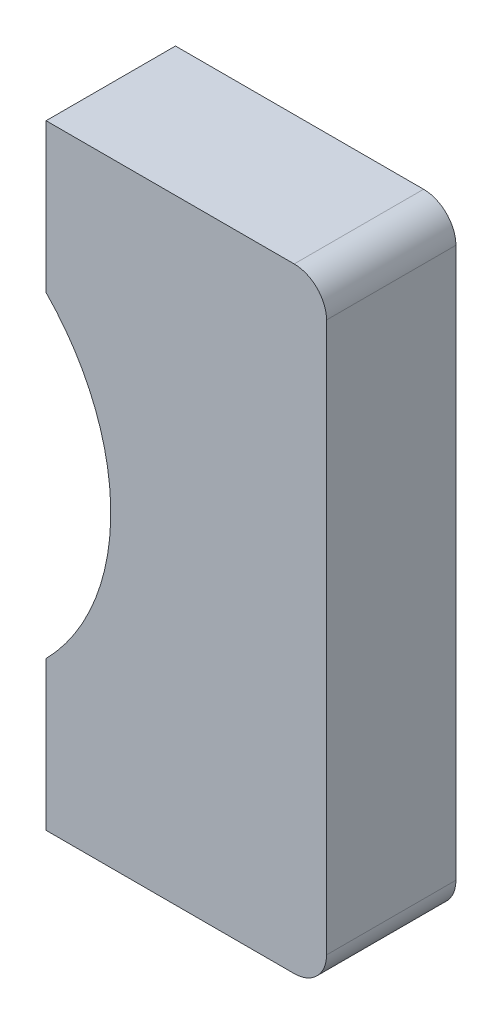
ISO-10303-21;
HEADER;
FILE_DESCRIPTION(('STEP AP214'),'2;1');
FILE_NAME('part.step','',(''),(''),'','','');
FILE_SCHEMA(('AUTOMOTIVE_DESIGN { 1 0 10303 214 1 1 1 1 }'));
ENDSEC;
DATA;
#1=APPLICATION_CONTEXT('core data for automotive mechanical design processes');
#2=APPLICATION_PROTOCOL_DEFINITION('international standard','automotive_design',2000,#1);
#3=PRODUCT_CONTEXT('',#1,'mechanical');
#4=PRODUCT('Part','Part','',(#3));
#5=PRODUCT_RELATED_PRODUCT_CATEGORY('part','',(#4));
#6=PRODUCT_DEFINITION_FORMATION('','',#4);
#7=PRODUCT_DEFINITION_CONTEXT('part definition',#1,'design');
#8=PRODUCT_DEFINITION('design','',#6,#7);
#9=PRODUCT_DEFINITION_SHAPE('','',#8);
#10=(LENGTH_UNIT() NAMED_UNIT(*) SI_UNIT(.MILLI.,.METRE.));
#11=(NAMED_UNIT(*) PLANE_ANGLE_UNIT() SI_UNIT($,.RADIAN.));
#12=(NAMED_UNIT(*) SI_UNIT($,.STERADIAN.) SOLID_ANGLE_UNIT());
#13=UNCERTAINTY_MEASURE_WITH_UNIT(LENGTH_MEASURE(1.E-05),#10,'distance_accuracy_value','');
#14=(GEOMETRIC_REPRESENTATION_CONTEXT(3) GLOBAL_UNCERTAINTY_ASSIGNED_CONTEXT((#13)) GLOBAL_UNIT_ASSIGNED_CONTEXT((#10,
#11,#12)) REPRESENTATION_CONTEXT('',''));
#15=CARTESIAN_POINT('',(0.,0.,0.));
#16=DIRECTION('',(0.,0.,1.));
#17=DIRECTION('',(1.,0.,0.));
#18=AXIS2_PLACEMENT_3D('',#15,#16,#17);
#19=CARTESIAN_POINT('',(7.21607439875603,-0.126900864643503,2.));
#20=DIRECTION('',(-1.,0.,0.));
#21=DIRECTION('',(0.,-1.,-4.37113882867379E-08));
#22=AXIS2_PLACEMENT_3D('',#19,#20,#21);
#23=PLANE('',#22);
#24=DIRECTION('',(0.,0.999999999999999,4.37113882867379E-08));
#25=VECTOR('',#24,1.);
#26=CARTESIAN_POINT('',(7.21607439875603,-4.37690077722073,-1.85773400218636E-07));
#27=LINE('',#26,#25);
#28=CARTESIAN_POINT('',(7.21607439875603,-4.37690077722073,-1.85773400218636E-07));
#29=VERTEX_POINT('',#28);
#30=CARTESIAN_POINT('',(7.21607439875603,4.12309922277927,1.85773400218636E-07));
#31=VERTEX_POINT('',#30);
#32=EDGE_CURVE('E11',#29,#31,#27,.T.);
#33=ORIENTED_EDGE('',*,*,#32,.T.);
#34=DIRECTION('',(0.,4.37113882867379E-08,-0.999999999999999));
#35=VECTOR('',#34,1.);
#36=CARTESIAN_POINT('',(7.21607439875603,4.1230991353565,2.0000001857734));
#37=LINE('',#36,#35);
#38=CARTESIAN_POINT('',(7.21607439875603,4.1230991353565,2.0000001857734));
#39=VERTEX_POINT('',#38);
#40=EDGE_CURVE('E146',#39,#31,#37,.T.);
#41=ORIENTED_EDGE('',*,*,#40,.F.);
#42=DIRECTION('',(0.,0.999999999999999,4.37113882867379E-08));
#43=VECTOR('',#42,1.);
#44=CARTESIAN_POINT('',(7.21607439875603,-4.3769008646435,1.9999998142266));
#45=LINE('',#44,#43);
#46=CARTESIAN_POINT('',(7.21607439875603,-4.3769008646435,1.9999998142266));
#47=VERTEX_POINT('',#46);
#48=EDGE_CURVE('E140',#47,#39,#45,.T.);
#49=ORIENTED_EDGE('',*,*,#48,.F.);
#50=DIRECTION('',(0.,4.37113882867379E-08,-0.999999999999999));
#51=VECTOR('',#50,1.);
#52=CARTESIAN_POINT('',(7.21607439875603,-4.3769008646435,1.9999998142266));
#53=LINE('',#52,#51);
#54=EDGE_CURVE('E97',#47,#29,#53,.T.);
#55=ORIENTED_EDGE('',*,*,#54,.T.);
#56=EDGE_LOOP('',(#33,#41,#49,#55));
#57=FACE_BOUND('',#56,.T.);
#58=ADVANCED_FACE('F17',(#57),#23,.F.);
#59=CARTESIAN_POINT('',(6.71607439875603,4.1230991353565,2.0000001857734));
#60=DIRECTION('',(0.,4.37113882867379E-08,-1.));
#61=DIRECTION('',(0.,1.,4.37113882867379E-08));
#62=AXIS2_PLACEMENT_3D('',#59,#60,#61);
#63=CYLINDRICAL_SURFACE('',#62,0.5);
#64=CARTESIAN_POINT('',(6.71607439875603,4.12309922277927,1.85773400218636E-07));
#65=DIRECTION('',(0.,-4.37113882867379E-08,1.));
#66=DIRECTION('',(1.,0.,0.));
#67=AXIS2_PLACEMENT_3D('',#64,#65,#66);
#68=CIRCLE('',#67,0.5);
#69=CARTESIAN_POINT('',(6.71607439875603,4.62309922277927,2.07629094362005E-07));
#70=VERTEX_POINT('',#69);
#71=EDGE_CURVE('E24',#31,#70,#68,.T.);
#72=ORIENTED_EDGE('',*,*,#71,.T.);
#73=DIRECTION('',(0.,4.37113882867379E-08,-0.999999999999999));
#74=VECTOR('',#73,1.);
#75=CARTESIAN_POINT('',(6.71607439875603,4.6230991353565,2.00000020762909));
#76=LINE('',#75,#74);
#77=CARTESIAN_POINT('',(6.71607439875603,4.6230991353565,2.00000020762909));
#78=VERTEX_POINT('',#77);
#79=EDGE_CURVE('E142',#78,#70,#76,.T.);
#80=ORIENTED_EDGE('',*,*,#79,.F.);
#81=CARTESIAN_POINT('',(6.71607439875603,4.1230991353565,2.0000001857734));
#82=DIRECTION('',(0.,-4.37113882867379E-08,1.));
#83=DIRECTION('',(1.,0.,0.));
#84=AXIS2_PLACEMENT_3D('',#81,#82,#83);
#85=CIRCLE('',#84,0.5);
#86=EDGE_CURVE('E132',#39,#78,#85,.T.);
#87=ORIENTED_EDGE('',*,*,#86,.F.);
#88=ORIENTED_EDGE('',*,*,#40,.T.);
#89=EDGE_LOOP('',(#72,#80,#87,#88));
#90=FACE_BOUND('',#89,.T.);
#91=ADVANCED_FACE('F148',(#90),#63,.T.);
#92=CARTESIAN_POINT('',(0.381074398756027,4.6230991353565,2.00000020762909));
#93=DIRECTION('',(0.,-1.,-4.37113882867379E-08));
#94=DIRECTION('',(1.,0.,0.));
#95=AXIS2_PLACEMENT_3D('',#92,#93,#94);
#96=PLANE('',#95);
#97=DIRECTION('',(-1.,0.,0.));
#98=VECTOR('',#97,1.);
#99=CARTESIAN_POINT('',(6.71607439875603,4.62309922277927,2.07629094362005E-07));
#100=LINE('',#99,#98);
#101=CARTESIAN_POINT('',(2.88107439875603,4.62309922277927,2.07629094362005E-07));
#102=VERTEX_POINT('',#101);
#103=EDGE_CURVE('E144',#70,#102,#100,.T.);
#104=ORIENTED_EDGE('',*,*,#103,.T.);
#105=DIRECTION('',(0.,4.37113882867379E-08,-0.999999999999999));
#106=VECTOR('',#105,1.);
#107=CARTESIAN_POINT('',(2.88107439875603,4.6230991353565,2.00000020762909));
#108=LINE('',#107,#106);
#109=CARTESIAN_POINT('',(2.88107439875603,4.6230991353565,2.00000020762909));
#110=VERTEX_POINT('',#109);
#111=EDGE_CURVE('E135',#110,#102,#108,.T.);
#112=ORIENTED_EDGE('',*,*,#111,.F.);
#113=DIRECTION('',(-1.,0.,0.));
#114=VECTOR('',#113,1.);
#115=CARTESIAN_POINT('',(6.71607439875603,4.6230991353565,2.00000020762909));
#116=LINE('',#115,#114);
#117=EDGE_CURVE('E122',#78,#110,#116,.T.);
#118=ORIENTED_EDGE('',*,*,#117,.F.);
#119=ORIENTED_EDGE('',*,*,#79,.T.);
#120=EDGE_LOOP('',(#104,#112,#118,#119));
#121=FACE_BOUND('',#120,.T.);
#122=ADVANCED_FACE('F154',(#121),#96,.F.);
#123=CARTESIAN_POINT('',(2.88107439875603,-0.126900864643503,2.));
#124=DIRECTION('',(1.,0.,0.));
#125=DIRECTION('',(0.,1.,4.37113882867379E-08));
#126=AXIS2_PLACEMENT_3D('',#123,#124,#125);
#127=PLANE('',#126);
#128=DIRECTION('',(0.,-0.999999999999999,-4.37113882867379E-08));
#129=VECTOR('',#128,1.);
#130=CARTESIAN_POINT('',(2.88107439875603,4.62309922277927,2.07629094362005E-07));
#131=LINE('',#130,#129);
#132=CARTESIAN_POINT('',(2.88107439875603,2.32258896556227,1.0707059725117E-07));
#133=VERTEX_POINT('',#132);
#134=EDGE_CURVE('E138',#102,#133,#131,.T.);
#135=ORIENTED_EDGE('',*,*,#134,.T.);
#136=DIRECTION('',(0.,4.37113882867379E-08,-0.999999999999999));
#137=VECTOR('',#136,1.);
#138=CARTESIAN_POINT('',(2.88107439875603,2.3225888781395,2.0000001070706));
#139=LINE('',#138,#137);
#140=CARTESIAN_POINT('',(2.88107439875603,2.3225888781395,2.0000001070706));
#141=VERTEX_POINT('',#140);
#142=EDGE_CURVE('E125',#141,#133,#139,.T.);
#143=ORIENTED_EDGE('',*,*,#142,.F.);
#144=DIRECTION('',(0.,-0.999999999999999,-4.37113882754165E-08));
#145=VECTOR('',#144,1.);
#146=CARTESIAN_POINT('',(2.88107439875603,4.6230991353565,2.00000020762909));
#147=LINE('',#146,#145);
#148=EDGE_CURVE('E114',#110,#141,#147,.T.);
#149=ORIENTED_EDGE('',*,*,#148,.F.);
#150=ORIENTED_EDGE('',*,*,#111,.T.);
#151=EDGE_LOOP('',(#135,#143,#149,#150));
#152=FACE_BOUND('',#151,.T.);
#153=ADVANCED_FACE('F158',(#152),#127,.F.);
#154=CARTESIAN_POINT('',(0.381074398756024,-0.126900864643503,2.));
#155=DIRECTION('',(0.,4.37113882867379E-08,-1.));
#156=DIRECTION('',(0.,1.,4.37113882867379E-08));
#157=AXIS2_PLACEMENT_3D('',#154,#155,#156);
#158=CYLINDRICAL_SURFACE('',#157,3.5);
#159=CARTESIAN_POINT('',(0.381074398756024,-0.126900777220726,0.));
#160=DIRECTION('',(0.,-4.37113882867379E-08,1.));
#161=DIRECTION('',(0.71428571428574,-0.699854212223739,-3.05915992146209E-08));
#162=AXIS2_PLACEMENT_3D('',#159,#160,#161);
#163=CIRCLE('',#162,3.5);
#164=CARTESIAN_POINT('',(2.88107439875603,-2.57639052000373,-1.0707059725117E-07));
#165=VERTEX_POINT('',#164);
#166=EDGE_CURVE('E128',#165,#133,#163,.T.);
#167=ORIENTED_EDGE('',*,*,#166,.F.);
#168=DIRECTION('',(0.,4.37113882867379E-08,-0.999999999999999));
#169=VECTOR('',#168,1.);
#170=CARTESIAN_POINT('',(2.88107439875603,-2.5763906074265,1.9999998929294));
#171=LINE('',#170,#169);
#172=CARTESIAN_POINT('',(2.88107439875603,-2.5763906074265,1.9999998929294));
#173=VERTEX_POINT('',#172);
#174=EDGE_CURVE('E117',#173,#165,#171,.T.);
#175=ORIENTED_EDGE('',*,*,#174,.F.);
#176=CARTESIAN_POINT('',(0.381074398756024,-0.126900864643503,2.));
#177=DIRECTION('',(0.,-4.37113882867379E-08,1.));
#178=DIRECTION('',(0.71428571428574,-0.699854212223739,-3.05915992146209E-08));
#179=AXIS2_PLACEMENT_3D('',#176,#177,#178);
#180=CIRCLE('',#179,3.5);
#181=EDGE_CURVE('E108',#173,#141,#180,.T.);
#182=ORIENTED_EDGE('',*,*,#181,.T.);
#183=ORIENTED_EDGE('',*,*,#142,.T.);
#184=EDGE_LOOP('',(#167,#175,#182,#183));
#185=FACE_BOUND('',#184,.T.);
#186=ADVANCED_FACE('F163',(#185),#158,.F.);
#187=CARTESIAN_POINT('',(2.88107439875603,-0.126900864643503,2.));
#188=DIRECTION('',(1.,0.,0.));
#189=DIRECTION('',(0.,1.,4.37113882867379E-08));
#190=AXIS2_PLACEMENT_3D('',#187,#188,#189);
#191=PLANE('',#190);
#192=DIRECTION('',(0.,-0.999999999999999,-4.37113882867379E-08));
#193=VECTOR('',#192,1.);
#194=CARTESIAN_POINT('',(2.88107439875603,-2.57639052000373,-1.0707059725117E-07));
#195=LINE('',#194,#193);
#196=CARTESIAN_POINT('',(2.88107439875603,-4.87690077722073,-2.07629094362005E-07));
#197=VERTEX_POINT('',#196);
#198=EDGE_CURVE('E120',#165,#197,#195,.T.);
#199=ORIENTED_EDGE('',*,*,#198,.T.);
#200=DIRECTION('',(0.,4.37113882867379E-08,-0.999999999999999));
#201=VECTOR('',#200,1.);
#202=CARTESIAN_POINT('',(2.88107439875603,-4.8769008646435,1.99999979237091));
#203=LINE('',#202,#201);
#204=CARTESIAN_POINT('',(2.88107439875603,-4.8769008646435,1.99999979237091));
#205=VERTEX_POINT('',#204);
#206=EDGE_CURVE('E111',#205,#197,#203,.T.);
#207=ORIENTED_EDGE('',*,*,#206,.F.);
#208=DIRECTION('',(0.,-0.999999999999999,-4.37113882754165E-08));
#209=VECTOR('',#208,1.);
#210=CARTESIAN_POINT('',(2.88107439875603,-2.5763906074265,1.9999998929294));
#211=LINE('',#210,#209);
#212=EDGE_CURVE('E91',#173,#205,#211,.T.);
#213=ORIENTED_EDGE('',*,*,#212,.F.);
#214=ORIENTED_EDGE('',*,*,#174,.T.);
#215=EDGE_LOOP('',(#199,#207,#213,#214));
#216=FACE_BOUND('',#215,.T.);
#217=ADVANCED_FACE('F161',(#216),#191,.F.);
#218=CARTESIAN_POINT('',(0.381074398756027,-4.8769008646435,1.99999979237091));
#219=DIRECTION('',(0.,-1.,-4.37113882867379E-08));
#220=DIRECTION('',(1.,0.,0.));
#221=AXIS2_PLACEMENT_3D('',#218,#219,#220);
#222=PLANE('',#221);
#223=DIRECTION('',(-1.,0.,0.));
#224=VECTOR('',#223,1.);
#225=CARTESIAN_POINT('',(6.71607439875603,-4.87690077722072,-2.07629094362005E-07));
#226=LINE('',#225,#224);
#227=CARTESIAN_POINT('',(6.71607439875603,-4.87690077722073,-2.07629094362005E-07));
#228=VERTEX_POINT('',#227);
#229=EDGE_CURVE('E86',#228,#197,#226,.T.);
#230=ORIENTED_EDGE('',*,*,#229,.F.);
#231=DIRECTION('',(0.,4.37113882867379E-08,-0.999999999999999));
#232=VECTOR('',#231,1.);
#233=CARTESIAN_POINT('',(6.71607439875603,-4.8769008646435,1.99999979237091));
#234=LINE('',#233,#232);
#235=CARTESIAN_POINT('',(6.71607439875603,-4.8769008646435,1.99999979237091));
#236=VERTEX_POINT('',#235);
#237=EDGE_CURVE('E78',#236,#228,#234,.T.);
#238=ORIENTED_EDGE('',*,*,#237,.F.);
#239=DIRECTION('',(-1.,0.,0.));
#240=VECTOR('',#239,1.);
#241=CARTESIAN_POINT('',(6.71607439875603,-4.87690086464349,1.99999979237091));
#242=LINE('',#241,#240);
#243=EDGE_CURVE('E83',#236,#205,#242,.T.);
#244=ORIENTED_EDGE('',*,*,#243,.T.);
#245=ORIENTED_EDGE('',*,*,#206,.T.);
#246=EDGE_LOOP('',(#230,#238,#244,#245));
#247=FACE_BOUND('',#246,.T.);
#248=ADVANCED_FACE('F80',(#247),#222,.T.);
#249=CARTESIAN_POINT('',(6.71607439875603,-4.3769008646435,1.9999998142266));
#250=DIRECTION('',(0.,4.37113882867379E-08,-1.));
#251=DIRECTION('',(0.,1.,4.37113882867379E-08));
#252=AXIS2_PLACEMENT_3D('',#249,#250,#251);
#253=CYLINDRICAL_SURFACE('',#252,0.5);
#254=CARTESIAN_POINT('',(6.71607439875603,-4.37690077722073,-1.85773400218636E-07));
#255=DIRECTION('',(0.,4.37113882867379E-08,-1.));
#256=DIRECTION('',(1.,0.,0.));
#257=AXIS2_PLACEMENT_3D('',#254,#255,#256);
#258=CIRCLE('',#257,0.5);
#259=EDGE_CURVE('E90',#29,#228,#258,.T.);
#260=ORIENTED_EDGE('',*,*,#259,.F.);
#261=ORIENTED_EDGE('',*,*,#54,.F.);
#262=CARTESIAN_POINT('',(6.71607439875603,-4.3769008646435,1.9999998142266));
#263=DIRECTION('',(0.,4.37113882867379E-08,-1.));
#264=DIRECTION('',(1.,0.,0.));
#265=AXIS2_PLACEMENT_3D('',#262,#263,#264);
#266=CIRCLE('',#265,0.5);
#267=EDGE_CURVE('E95',#47,#236,#266,.T.);
#268=ORIENTED_EDGE('',*,*,#267,.T.);
#269=ORIENTED_EDGE('',*,*,#237,.T.);
#270=EDGE_LOOP('',(#260,#261,#268,#269));
#271=FACE_BOUND('',#270,.T.);
#272=ADVANCED_FACE('F96',(#271),#253,.T.);
#273=CARTESIAN_POINT('',(0.381074398756027,-0.126900864643503,2.));
#274=DIRECTION('',(0.,-4.37113882867379E-08,1.));
#275=DIRECTION('',(0.,-1.,-4.37113882867379E-08));
#276=AXIS2_PLACEMENT_3D('',#273,#274,#275);
#277=PLANE('',#276);
#278=ORIENTED_EDGE('',*,*,#48,.T.);
#279=ORIENTED_EDGE('',*,*,#86,.T.);
#280=ORIENTED_EDGE('',*,*,#117,.T.);
#281=ORIENTED_EDGE('',*,*,#148,.T.);
#282=ORIENTED_EDGE('',*,*,#181,.F.);
#283=ORIENTED_EDGE('',*,*,#212,.T.);
#284=ORIENTED_EDGE('',*,*,#243,.F.);
#285=ORIENTED_EDGE('',*,*,#267,.F.);
#286=EDGE_LOOP('',(#278,#279,#280,#281,#282,#283,#284,#285));
#287=FACE_BOUND('',#286,.T.);
#288=ADVANCED_FACE('F101',(#287),#277,.T.);
#289=CARTESIAN_POINT('',(0.381074398756027,-0.126900777220726,0.));
#290=DIRECTION('',(0.,-4.37113882867379E-08,1.));
#291=DIRECTION('',(0.,-1.,-4.37113882867379E-08));
#292=AXIS2_PLACEMENT_3D('',#289,#290,#291);
#293=PLANE('',#292);
#294=ORIENTED_EDGE('',*,*,#32,.F.);
#295=ORIENTED_EDGE('',*,*,#259,.T.);
#296=ORIENTED_EDGE('',*,*,#229,.T.);
#297=ORIENTED_EDGE('',*,*,#198,.F.);
#298=ORIENTED_EDGE('',*,*,#166,.T.);
#299=ORIENTED_EDGE('',*,*,#134,.F.);
#300=ORIENTED_EDGE('',*,*,#103,.F.);
#301=ORIENTED_EDGE('',*,*,#71,.F.);
#302=EDGE_LOOP('',(#294,#295,#296,#297,#298,#299,#300,#301));
#303=FACE_BOUND('',#302,.T.);
#304=ADVANCED_FACE('F151',(#303),#293,.F.);
#305=CLOSED_SHELL('',(#58,#91,#122,#153,#186,#217,#248,#272,#288,#304));
#306=MANIFOLD_SOLID_BREP('B1',#305);
#307=ADVANCED_BREP_SHAPE_REPRESENTATION('',(#18,#306),#14);
#308=SHAPE_DEFINITION_REPRESENTATION(#9,#307);
ENDSEC;
END-ISO-10303-21;
